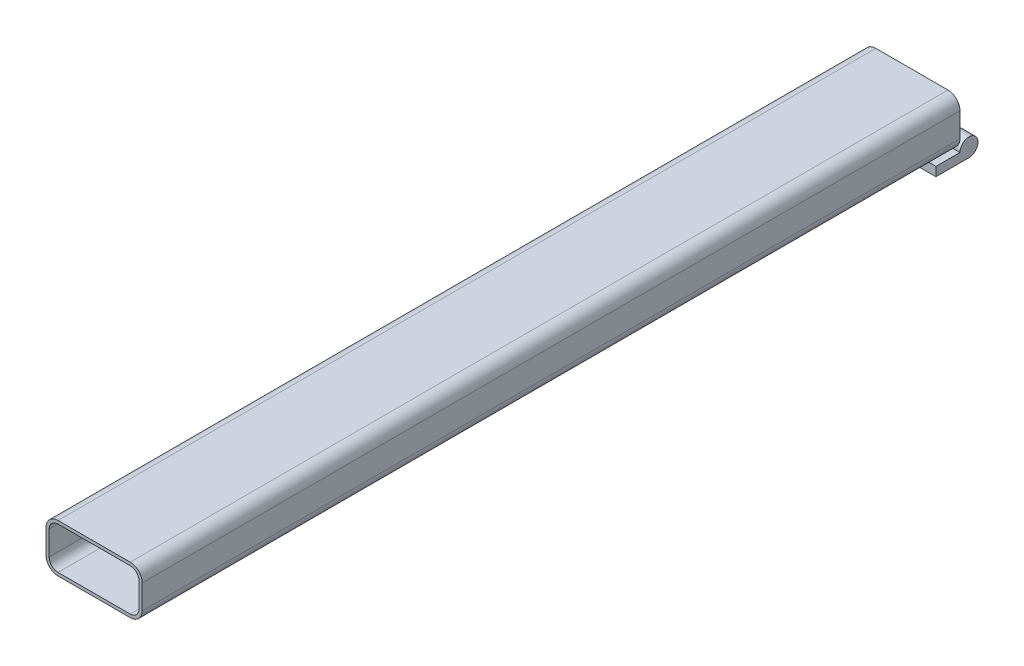
ISO-10303-21;
HEADER;
FILE_DESCRIPTION(('STEP AP214'),'2;1');
FILE_NAME('part.step','',(''),(''),'','','');
FILE_SCHEMA(('AUTOMOTIVE_DESIGN { 1 0 10303 214 1 1 1 1 }'));
ENDSEC;
DATA;
#1=APPLICATION_CONTEXT('core data for automotive mechanical design processes');
#2=APPLICATION_PROTOCOL_DEFINITION('international standard','automotive_design',2000,#1);
#3=PRODUCT_CONTEXT('',#1,'mechanical');
#4=PRODUCT('Part','Part','',(#3));
#5=PRODUCT_RELATED_PRODUCT_CATEGORY('part','',(#4));
#6=PRODUCT_DEFINITION_FORMATION('','',#4);
#7=PRODUCT_DEFINITION_CONTEXT('part definition',#1,'design');
#8=PRODUCT_DEFINITION('design','',#6,#7);
#9=PRODUCT_DEFINITION_SHAPE('','',#8);
#10=(LENGTH_UNIT() NAMED_UNIT(*) SI_UNIT(.MILLI.,.METRE.));
#11=(NAMED_UNIT(*) PLANE_ANGLE_UNIT() SI_UNIT($,.RADIAN.));
#12=(NAMED_UNIT(*) SI_UNIT($,.STERADIAN.) SOLID_ANGLE_UNIT());
#13=UNCERTAINTY_MEASURE_WITH_UNIT(LENGTH_MEASURE(1.E-05),#10,'distance_accuracy_value','');
#14=(GEOMETRIC_REPRESENTATION_CONTEXT(3) GLOBAL_UNCERTAINTY_ASSIGNED_CONTEXT((#13)) GLOBAL_UNIT_ASSIGNED_CONTEXT((#10,
#11,#12)) REPRESENTATION_CONTEXT('',''));
#15=CARTESIAN_POINT('',(0.,0.,0.));
#16=DIRECTION('',(0.,0.,1.));
#17=DIRECTION('',(1.,0.,0.));
#18=AXIS2_PLACEMENT_3D('',#15,#16,#17);
#19=CARTESIAN_POINT('',(-25.4,-12.7,-220.6625));
#20=DIRECTION('',(1.,0.,0.));
#21=DIRECTION('',(0.,0.,-1.));
#22=AXIS2_PLACEMENT_3D('',#19,#20,#21);
#23=CYLINDRICAL_SURFACE('',#22,4.7625);
#24=CARTESIAN_POINT('',(-9.525,-12.7,-220.6625));
#25=DIRECTION('',(-1.,0.,0.));
#26=DIRECTION('',(0.,0.,1.));
#27=AXIS2_PLACEMENT_3D('',#24,#25,#26);
#28=CIRCLE('',#27,4.7625);
#29=CARTESIAN_POINT('',(-9.52499999999999,-17.4625000000001,-220.6625));
#30=VERTEX_POINT('',#29);
#31=CARTESIAN_POINT('',(-9.525,-12.7,-215.9));
#32=VERTEX_POINT('',#31);
#33=EDGE_CURVE('E221',#30,#32,#28,.F.);
#34=ORIENTED_EDGE('',*,*,#33,.F.);
#35=DIRECTION('',(1.,0.,0.));
#36=VECTOR('',#35,1.);
#37=CARTESIAN_POINT('',(-25.4,-17.4625,-220.6625));
#38=LINE('',#37,#36);
#39=CARTESIAN_POINT('',(-25.4,-17.4625,-220.6625));
#40=VERTEX_POINT('',#39);
#41=EDGE_CURVE('E253',#40,#30,#38,.T.);
#42=ORIENTED_EDGE('',*,*,#41,.F.);
#43=CARTESIAN_POINT('',(-25.4,-12.7,-220.6625));
#44=DIRECTION('',(1.,0.,0.));
#45=DIRECTION('',(0.,0.,-1.));
#46=AXIS2_PLACEMENT_3D('',#43,#44,#45);
#47=CIRCLE('',#46,4.7625);
#48=CARTESIAN_POINT('',(-25.4,-12.7,-215.9));
#49=VERTEX_POINT('',#48);
#50=EDGE_CURVE('E234',#40,#49,#47,.T.);
#51=ORIENTED_EDGE('',*,*,#50,.T.);
#52=DIRECTION('',(1.,0.,0.));
#53=VECTOR('',#52,1.);
#54=CARTESIAN_POINT('',(-25.4,-12.7,-215.9));
#55=LINE('',#54,#53);
#56=CARTESIAN_POINT('',(-19.05,-12.7,-215.9));
#57=VERTEX_POINT('',#56);
#58=EDGE_CURVE('E248',#49,#57,#55,.T.);
#59=ORIENTED_EDGE('',*,*,#58,.T.);
#60=DIRECTION('',(1.,0.,0.));
#61=VECTOR('',#60,1.);
#62=CARTESIAN_POINT('',(-19.05,-12.7,-215.9));
#63=LINE('',#62,#61);
#64=EDGE_CURVE('E341',#57,#32,#63,.T.);
#65=ORIENTED_EDGE('',*,*,#64,.T.);
#66=EDGE_LOOP('',(#34,#42,#51,#59,#65));
#67=FACE_BOUND('',#66,.T.);
#68=ADVANCED_FACE('F35',(#67),#23,.T.);
#69=CARTESIAN_POINT('',(-19.05,-6.35,215.9));
#70=DIRECTION('',(0.,0.,-1.));
#71=DIRECTION('',(-1.,0.,0.));
#72=AXIS2_PLACEMENT_3D('',#69,#70,#71);
#73=PLANE('',#72);
#74=CARTESIAN_POINT('',(-19.05,-6.35,215.9));
#75=DIRECTION('',(0.,0.,1.));
#76=DIRECTION('',(-1.,0.,0.));
#77=AXIS2_PLACEMENT_3D('',#74,#75,#76);
#78=CIRCLE('',#77,6.35);
#79=CARTESIAN_POINT('',(-25.4,-6.35,215.9));
#80=VERTEX_POINT('',#79);
#81=CARTESIAN_POINT('',(-19.05,-12.7,215.9));
#82=VERTEX_POINT('',#81);
#83=EDGE_CURVE('E320',#80,#82,#78,.T.);
#84=ORIENTED_EDGE('',*,*,#83,.T.);
#85=DIRECTION('',(1.,0.,0.));
#86=VECTOR('',#85,1.);
#87=CARTESIAN_POINT('',(-19.05,-12.7,215.9));
#88=LINE('',#87,#86);
#89=CARTESIAN_POINT('',(19.05,-12.7,215.9));
#90=VERTEX_POINT('',#89);
#91=EDGE_CURVE('E323',#82,#90,#88,.T.);
#92=ORIENTED_EDGE('',*,*,#91,.T.);
#93=CARTESIAN_POINT('',(19.05,-6.35,215.9));
#94=DIRECTION('',(0.,0.,1.));
#95=DIRECTION('',(1.,0.,0.));
#96=AXIS2_PLACEMENT_3D('',#93,#94,#95);
#97=CIRCLE('',#96,6.35);
#98=CARTESIAN_POINT('',(25.4,-6.35,215.9));
#99=VERTEX_POINT('',#98);
#100=EDGE_CURVE('E326',#90,#99,#97,.T.);
#101=ORIENTED_EDGE('',*,*,#100,.T.);
#102=DIRECTION('',(0.,1.,0.));
#103=VECTOR('',#102,1.);
#104=CARTESIAN_POINT('',(25.4,-6.35,215.9));
#105=LINE('',#104,#103);
#106=CARTESIAN_POINT('',(25.4,6.35,215.9));
#107=VERTEX_POINT('',#106);
#108=EDGE_CURVE('E328',#99,#107,#105,.T.);
#109=ORIENTED_EDGE('',*,*,#108,.T.);
#110=CARTESIAN_POINT('',(19.05,6.35,215.9));
#111=DIRECTION('',(0.,0.,1.));
#112=DIRECTION('',(-1.,0.,0.));
#113=AXIS2_PLACEMENT_3D('',#110,#111,#112);
#114=CIRCLE('',#113,6.35);
#115=CARTESIAN_POINT('',(19.05,12.7,215.9));
#116=VERTEX_POINT('',#115);
#117=EDGE_CURVE('E330',#107,#116,#114,.T.);
#118=ORIENTED_EDGE('',*,*,#117,.T.);
#119=DIRECTION('',(-1.,0.,0.));
#120=VECTOR('',#119,1.);
#121=CARTESIAN_POINT('',(-19.05,12.7,215.9));
#122=LINE('',#121,#120);
#123=CARTESIAN_POINT('',(-19.05,12.7,215.9));
#124=VERTEX_POINT('',#123);
#125=EDGE_CURVE('E332',#116,#124,#122,.T.);
#126=ORIENTED_EDGE('',*,*,#125,.T.);
#127=CARTESIAN_POINT('',(-19.05,6.35,215.9));
#128=DIRECTION('',(0.,0.,1.));
#129=DIRECTION('',(-1.,0.,0.));
#130=AXIS2_PLACEMENT_3D('',#127,#128,#129);
#131=CIRCLE('',#130,6.35);
#132=CARTESIAN_POINT('',(-25.4,6.35,215.9));
#133=VERTEX_POINT('',#132);
#134=EDGE_CURVE('E334',#124,#133,#131,.T.);
#135=ORIENTED_EDGE('',*,*,#134,.T.);
#136=DIRECTION('',(0.,-1.,0.));
#137=VECTOR('',#136,1.);
#138=CARTESIAN_POINT('',(-25.4,-6.35,215.9));
#139=LINE('',#138,#137);
#140=EDGE_CURVE('E336',#133,#80,#139,.T.);
#141=ORIENTED_EDGE('',*,*,#140,.T.);
#142=EDGE_LOOP('',(#84,#92,#101,#109,#118,#126,#135,#141));
#143=FACE_BOUND('',#142,.T.);
#144=CARTESIAN_POINT('',(-19.05,6.35,215.9));
#145=DIRECTION('',(0.,0.,1.));
#146=DIRECTION('',(-1.,0.,0.));
#147=AXIS2_PLACEMENT_3D('',#144,#145,#146);
#148=CIRCLE('',#147,4.699);
#149=CARTESIAN_POINT('',(-19.05,11.049,215.9));
#150=VERTEX_POINT('',#149);
#151=CARTESIAN_POINT('',(-23.749,6.35,215.9));
#152=VERTEX_POINT('',#151);
#153=EDGE_CURVE('E264',#150,#152,#148,.T.);
#154=ORIENTED_EDGE('',*,*,#153,.F.);
#155=DIRECTION('',(-1.,0.,0.));
#156=VECTOR('',#155,1.);
#157=CARTESIAN_POINT('',(-19.05,11.049,215.9));
#158=LINE('',#157,#156);
#159=CARTESIAN_POINT('',(19.05,11.049,215.9));
#160=VERTEX_POINT('',#159);
#161=EDGE_CURVE('E279',#160,#150,#158,.T.);
#162=ORIENTED_EDGE('',*,*,#161,.F.);
#163=CARTESIAN_POINT('',(19.05,6.35,215.9));
#164=DIRECTION('',(0.,0.,1.));
#165=DIRECTION('',(-1.,0.,0.));
#166=AXIS2_PLACEMENT_3D('',#163,#164,#165);
#167=CIRCLE('',#166,4.699);
#168=CARTESIAN_POINT('',(23.749,6.35,215.9));
#169=VERTEX_POINT('',#168);
#170=EDGE_CURVE('E277',#169,#160,#167,.T.);
#171=ORIENTED_EDGE('',*,*,#170,.F.);
#172=DIRECTION('',(0.,1.,0.));
#173=VECTOR('',#172,1.);
#174=CARTESIAN_POINT('',(23.749,-6.35,215.9));
#175=LINE('',#174,#173);
#176=CARTESIAN_POINT('',(23.749,-6.35,215.9));
#177=VERTEX_POINT('',#176);
#178=EDGE_CURVE('E275',#177,#169,#175,.T.);
#179=ORIENTED_EDGE('',*,*,#178,.F.);
#180=CARTESIAN_POINT('',(19.05,-6.35,215.9));
#181=DIRECTION('',(0.,0.,1.));
#182=DIRECTION('',(1.,0.,0.));
#183=AXIS2_PLACEMENT_3D('',#180,#181,#182);
#184=CIRCLE('',#183,4.699);
#185=CARTESIAN_POINT('',(19.05,-11.049,215.9));
#186=VERTEX_POINT('',#185);
#187=EDGE_CURVE('E273',#186,#177,#184,.T.);
#188=ORIENTED_EDGE('',*,*,#187,.F.);
#189=DIRECTION('',(1.,0.,0.));
#190=VECTOR('',#189,1.);
#191=CARTESIAN_POINT('',(-19.05,-11.049,215.9));
#192=LINE('',#191,#190);
#193=CARTESIAN_POINT('',(-19.05,-11.049,215.9));
#194=VERTEX_POINT('',#193);
#195=EDGE_CURVE('E271',#194,#186,#192,.T.);
#196=ORIENTED_EDGE('',*,*,#195,.F.);
#197=CARTESIAN_POINT('',(-19.05,-6.35,215.9));
#198=DIRECTION('',(0.,0.,1.));
#199=DIRECTION('',(-1.,0.,0.));
#200=AXIS2_PLACEMENT_3D('',#197,#198,#199);
#201=CIRCLE('',#200,4.699);
#202=CARTESIAN_POINT('',(-23.749,-6.35,215.9));
#203=VERTEX_POINT('',#202);
#204=EDGE_CURVE('E269',#203,#194,#201,.T.);
#205=ORIENTED_EDGE('',*,*,#204,.F.);
#206=DIRECTION('',(0.,-1.,0.));
#207=VECTOR('',#206,1.);
#208=CARTESIAN_POINT('',(-23.749,-6.35,215.9));
#209=LINE('',#208,#207);
#210=EDGE_CURVE('E266',#152,#203,#209,.T.);
#211=ORIENTED_EDGE('',*,*,#210,.F.);
#212=EDGE_LOOP('',(#154,#162,#171,#179,#188,#196,#205,#211));
#213=FACE_BOUND('',#212,.T.);
#214=ADVANCED_FACE('F432',(#143,#213),#73,.F.);
#215=CARTESIAN_POINT('',(-19.05,-6.35,-215.9));
#216=DIRECTION('',(0.,0.,-1.));
#217=DIRECTION('',(-1.,0.,0.));
#218=AXIS2_PLACEMENT_3D('',#215,#216,#217);
#219=PLANE('',#218);
#220=DIRECTION('',(1.,0.,0.));
#221=VECTOR('',#220,1.);
#222=CARTESIAN_POINT('',(-19.05,-11.049,-215.9));
#223=LINE('',#222,#221);
#224=CARTESIAN_POINT('',(-19.05,-11.049,-215.9));
#225=VERTEX_POINT('',#224);
#226=CARTESIAN_POINT('',(19.05,-11.049,-215.9));
#227=VERTEX_POINT('',#226);
#228=EDGE_CURVE('E290',#225,#227,#223,.T.);
#229=ORIENTED_EDGE('',*,*,#228,.T.);
#230=CARTESIAN_POINT('',(19.05,-6.35,-215.9));
#231=DIRECTION('',(0.,0.,1.));
#232=DIRECTION('',(1.,0.,0.));
#233=AXIS2_PLACEMENT_3D('',#230,#231,#232);
#234=CIRCLE('',#233,4.699);
#235=CARTESIAN_POINT('',(23.749,-6.35,-215.9));
#236=VERTEX_POINT('',#235);
#237=EDGE_CURVE('E292',#227,#236,#234,.T.);
#238=ORIENTED_EDGE('',*,*,#237,.T.);
#239=DIRECTION('',(0.,1.,0.));
#240=VECTOR('',#239,1.);
#241=CARTESIAN_POINT('',(23.749,-6.35,-215.9));
#242=LINE('',#241,#240);
#243=CARTESIAN_POINT('',(23.749,6.35,-215.9));
#244=VERTEX_POINT('',#243);
#245=EDGE_CURVE('E295',#236,#244,#242,.T.);
#246=ORIENTED_EDGE('',*,*,#245,.T.);
#247=CARTESIAN_POINT('',(19.05,6.35,-215.9));
#248=DIRECTION('',(0.,0.,1.));
#249=DIRECTION('',(-1.,0.,0.));
#250=AXIS2_PLACEMENT_3D('',#247,#248,#249);
#251=CIRCLE('',#250,4.699);
#252=CARTESIAN_POINT('',(19.05,11.049,-215.9));
#253=VERTEX_POINT('',#252);
#254=EDGE_CURVE('E298',#244,#253,#251,.T.);
#255=ORIENTED_EDGE('',*,*,#254,.T.);
#256=DIRECTION('',(-1.,0.,0.));
#257=VECTOR('',#256,1.);
#258=CARTESIAN_POINT('',(-19.05,11.049,-215.9));
#259=LINE('',#258,#257);
#260=CARTESIAN_POINT('',(-19.05,11.049,-215.9));
#261=VERTEX_POINT('',#260);
#262=EDGE_CURVE('E267',#253,#261,#259,.T.);
#263=ORIENTED_EDGE('',*,*,#262,.T.);
#264=CARTESIAN_POINT('',(-19.05,6.35,-215.9));
#265=DIRECTION('',(0.,0.,1.));
#266=DIRECTION('',(-1.,0.,0.));
#267=AXIS2_PLACEMENT_3D('',#264,#265,#266);
#268=CIRCLE('',#267,4.699);
#269=CARTESIAN_POINT('',(-23.749,6.35,-215.9));
#270=VERTEX_POINT('',#269);
#271=EDGE_CURVE('E263',#261,#270,#268,.T.);
#272=ORIENTED_EDGE('',*,*,#271,.T.);
#273=DIRECTION('',(0.,-1.,0.));
#274=VECTOR('',#273,1.);
#275=CARTESIAN_POINT('',(-23.749,-6.35,-215.9));
#276=LINE('',#275,#274);
#277=CARTESIAN_POINT('',(-23.749,-6.35,-215.9));
#278=VERTEX_POINT('',#277);
#279=EDGE_CURVE('E284',#270,#278,#276,.T.);
#280=ORIENTED_EDGE('',*,*,#279,.T.);
#281=CARTESIAN_POINT('',(-19.05,-6.35,-215.9));
#282=DIRECTION('',(0.,0.,1.));
#283=DIRECTION('',(-1.,0.,0.));
#284=AXIS2_PLACEMENT_3D('',#281,#282,#283);
#285=CIRCLE('',#284,4.699);
#286=EDGE_CURVE('E287',#278,#225,#285,.T.);
#287=ORIENTED_EDGE('',*,*,#286,.T.);
#288=EDGE_LOOP('',(#229,#238,#246,#255,#263,#272,#280,#287));
#289=FACE_BOUND('',#288,.T.);
#290=DIRECTION('',(0.,-1.,0.));
#291=VECTOR('',#290,1.);
#292=CARTESIAN_POINT('',(-9.525,12.7,-215.9));
#293=LINE('',#292,#291);
#294=CARTESIAN_POINT('',(-9.525,-17.4625000000001,-215.9));
#295=VERTEX_POINT('',#294);
#296=EDGE_CURVE('E206',#32,#295,#293,.T.);
#297=ORIENTED_EDGE('',*,*,#296,.F.);
#298=ORIENTED_EDGE('',*,*,#64,.F.);
#299=CARTESIAN_POINT('',(-19.05,-6.35,-215.9));
#300=DIRECTION('',(0.,0.,1.));
#301=DIRECTION('',(-1.,0.,0.));
#302=AXIS2_PLACEMENT_3D('',#299,#300,#301);
#303=CIRCLE('',#302,6.35);
#304=CARTESIAN_POINT('',(-25.4,-6.35,-215.9));
#305=VERTEX_POINT('',#304);
#306=EDGE_CURVE('E319',#305,#57,#303,.T.);
#307=ORIENTED_EDGE('',*,*,#306,.F.);
#308=DIRECTION('',(0.,-1.,0.));
#309=VECTOR('',#308,1.);
#310=CARTESIAN_POINT('',(-25.4,-6.35,-215.9));
#311=LINE('',#310,#309);
#312=CARTESIAN_POINT('',(-25.4,6.35,-215.9));
#313=VERTEX_POINT('',#312);
#314=EDGE_CURVE('E324',#313,#305,#311,.T.);
#315=ORIENTED_EDGE('',*,*,#314,.F.);
#316=CARTESIAN_POINT('',(-19.05,6.35,-215.9));
#317=DIRECTION('',(0.,0.,1.));
#318=DIRECTION('',(-1.,0.,0.));
#319=AXIS2_PLACEMENT_3D('',#316,#317,#318);
#320=CIRCLE('',#319,6.35);
#321=CARTESIAN_POINT('',(-19.05,12.7,-215.9));
#322=VERTEX_POINT('',#321);
#323=EDGE_CURVE('E352',#322,#313,#320,.T.);
#324=ORIENTED_EDGE('',*,*,#323,.F.);
#325=DIRECTION('',(-1.,0.,0.));
#326=VECTOR('',#325,1.);
#327=CARTESIAN_POINT('',(-19.05,12.7,-215.9));
#328=LINE('',#327,#326);
#329=CARTESIAN_POINT('',(19.05,12.7,-215.9));
#330=VERTEX_POINT('',#329);
#331=EDGE_CURVE('E350',#330,#322,#328,.T.);
#332=ORIENTED_EDGE('',*,*,#331,.F.);
#333=CARTESIAN_POINT('',(19.05,6.35,-215.9));
#334=DIRECTION('',(0.,0.,1.));
#335=DIRECTION('',(-1.,0.,0.));
#336=AXIS2_PLACEMENT_3D('',#333,#334,#335);
#337=CIRCLE('',#336,6.35);
#338=CARTESIAN_POINT('',(25.4,6.35,-215.9));
#339=VERTEX_POINT('',#338);
#340=EDGE_CURVE('E348',#339,#330,#337,.T.);
#341=ORIENTED_EDGE('',*,*,#340,.F.);
#342=DIRECTION('',(0.,1.,0.));
#343=VECTOR('',#342,1.);
#344=CARTESIAN_POINT('',(25.4,-6.35,-215.9));
#345=LINE('',#344,#343);
#346=CARTESIAN_POINT('',(25.4,-6.35,-215.9));
#347=VERTEX_POINT('',#346);
#348=EDGE_CURVE('E346',#347,#339,#345,.T.);
#349=ORIENTED_EDGE('',*,*,#348,.F.);
#350=CARTESIAN_POINT('',(19.05,-6.35,-215.9));
#351=DIRECTION('',(0.,0.,1.));
#352=DIRECTION('',(1.,0.,0.));
#353=AXIS2_PLACEMENT_3D('',#350,#351,#352);
#354=CIRCLE('',#353,6.35);
#355=CARTESIAN_POINT('',(19.05,-12.7,-215.9));
#356=VERTEX_POINT('',#355);
#357=EDGE_CURVE('E344',#356,#347,#354,.T.);
#358=ORIENTED_EDGE('',*,*,#357,.F.);
#359=CARTESIAN_POINT('',(9.525,-12.7,-215.9));
#360=VERTEX_POINT('',#359);
#361=EDGE_CURVE('E205',#360,#356,#63,.T.);
#362=ORIENTED_EDGE('',*,*,#361,.F.);
#363=DIRECTION('',(0.,-1.,0.));
#364=VECTOR('',#363,1.);
#365=CARTESIAN_POINT('',(9.52500000000001,12.7,-215.9));
#366=LINE('',#365,#364);
#367=CARTESIAN_POINT('',(9.52500000000001,-17.4625000000001,-215.9));
#368=VERTEX_POINT('',#367);
#369=EDGE_CURVE('E198',#360,#368,#366,.T.);
#370=ORIENTED_EDGE('',*,*,#369,.T.);
#371=DIRECTION('',(-1.,0.,0.));
#372=VECTOR('',#371,1.);
#373=CARTESIAN_POINT('',(-9.525,-17.4625000000001,-215.9));
#374=LINE('',#373,#372);
#375=EDGE_CURVE('E202',#368,#295,#374,.T.);
#376=ORIENTED_EDGE('',*,*,#375,.T.);
#377=EDGE_LOOP('',(#297,#298,#307,#315,#324,#332,#341,#349,#358,#362,#370,#376));
#378=FACE_BOUND('',#377,.T.);
#379=ADVANCED_FACE('F200',(#289,#378),#219,.T.);
#380=CARTESIAN_POINT('',(-19.05,-6.35,215.9));
#381=DIRECTION('',(0.,0.,-1.));
#382=DIRECTION('',(-1.,0.,0.));
#383=AXIS2_PLACEMENT_3D('',#380,#381,#382);
#384=CYLINDRICAL_SURFACE('',#383,6.35);
#385=ORIENTED_EDGE('',*,*,#306,.T.);
#386=DIRECTION('',(0.,0.,-1.));
#387=VECTOR('',#386,1.);
#388=CARTESIAN_POINT('',(-19.05,-12.7,215.9));
#389=LINE('',#388,#387);
#390=CARTESIAN_POINT('',(-19.05,-12.7,-203.2));
#391=VERTEX_POINT('',#390);
#392=EDGE_CURVE('E251',#391,#57,#389,.T.);
#393=ORIENTED_EDGE('',*,*,#392,.F.);
#394=DIRECTION('',(0.,0.,-1.));
#395=VECTOR('',#394,1.);
#396=CARTESIAN_POINT('',(-19.05,-12.7,215.9));
#397=LINE('',#396,#395);
#398=EDGE_CURVE('E213',#82,#391,#397,.T.);
#399=ORIENTED_EDGE('',*,*,#398,.F.);
#400=ORIENTED_EDGE('',*,*,#83,.F.);
#401=DIRECTION('',(0.,0.,-1.));
#402=VECTOR('',#401,1.);
#403=CARTESIAN_POINT('',(-25.4,-6.35,215.9));
#404=LINE('',#403,#402);
#405=EDGE_CURVE('E338',#80,#305,#404,.T.);
#406=ORIENTED_EDGE('',*,*,#405,.T.);
#407=EDGE_LOOP('',(#385,#393,#399,#400,#406));
#408=FACE_BOUND('',#407,.T.);
#409=ADVANCED_FACE('F37',(#408),#384,.T.);
#410=CARTESIAN_POINT('',(-19.05,-12.7,215.9));
#411=DIRECTION('',(0.,1.,0.));
#412=DIRECTION('',(0.,0.,1.));
#413=AXIS2_PLACEMENT_3D('',#410,#411,#412);
#414=PLANE('',#413);
#415=ORIENTED_EDGE('',*,*,#398,.T.);
#416=DIRECTION('',(1.,0.,0.));
#417=VECTOR('',#416,1.);
#418=CARTESIAN_POINT('',(-25.4,-12.7,-203.2));
#419=LINE('',#418,#417);
#420=CARTESIAN_POINT('',(19.05,-12.7,-203.2));
#421=VERTEX_POINT('',#420);
#422=EDGE_CURVE('E261',#391,#421,#419,.T.);
#423=ORIENTED_EDGE('',*,*,#422,.T.);
#424=DIRECTION('',(0.,0.,-1.));
#425=VECTOR('',#424,1.);
#426=CARTESIAN_POINT('',(19.05,-12.7,215.9));
#427=LINE('',#426,#425);
#428=EDGE_CURVE('E373',#90,#421,#427,.T.);
#429=ORIENTED_EDGE('',*,*,#428,.F.);
#430=ORIENTED_EDGE('',*,*,#91,.F.);
#431=EDGE_LOOP('',(#415,#423,#429,#430));
#432=FACE_BOUND('',#431,.T.);
#433=ADVANCED_FACE('F380',(#432),#414,.F.);
#434=CARTESIAN_POINT('',(19.05,-6.35,215.9));
#435=DIRECTION('',(0.,0.,-1.));
#436=DIRECTION('',(-1.,0.,0.));
#437=AXIS2_PLACEMENT_3D('',#434,#435,#436);
#438=CYLINDRICAL_SURFACE('',#437,6.35);
#439=ORIENTED_EDGE('',*,*,#357,.T.);
#440=DIRECTION('',(0.,0.,-1.));
#441=VECTOR('',#440,1.);
#442=CARTESIAN_POINT('',(25.4,-6.35,215.9));
#443=LINE('',#442,#441);
#444=EDGE_CURVE('E369',#99,#347,#443,.T.);
#445=ORIENTED_EDGE('',*,*,#444,.F.);
#446=ORIENTED_EDGE('',*,*,#100,.F.);
#447=ORIENTED_EDGE('',*,*,#428,.T.);
#448=EDGE_CURVE('E372',#421,#356,#427,.T.);
#449=ORIENTED_EDGE('',*,*,#448,.T.);
#450=EDGE_LOOP('',(#439,#445,#446,#447,#449));
#451=FACE_BOUND('',#450,.T.);
#452=ADVANCED_FACE('F416',(#451),#438,.T.);
#453=CARTESIAN_POINT('',(25.4,-6.35,215.9));
#454=DIRECTION('',(-1.,0.,0.));
#455=DIRECTION('',(0.,0.,1.));
#456=AXIS2_PLACEMENT_3D('',#453,#454,#455);
#457=PLANE('',#456);
#458=ORIENTED_EDGE('',*,*,#348,.T.);
#459=DIRECTION('',(0.,0.,-1.));
#460=VECTOR('',#459,1.);
#461=CARTESIAN_POINT('',(25.4,6.35,215.9));
#462=LINE('',#461,#460);
#463=EDGE_CURVE('E366',#107,#339,#462,.T.);
#464=ORIENTED_EDGE('',*,*,#463,.F.);
#465=ORIENTED_EDGE('',*,*,#108,.F.);
#466=ORIENTED_EDGE('',*,*,#444,.T.);
#467=EDGE_LOOP('',(#458,#464,#465,#466));
#468=FACE_BOUND('',#467,.T.);
#469=ADVANCED_FACE('F424',(#468),#457,.F.);
#470=CARTESIAN_POINT('',(19.05,6.35,215.9));
#471=DIRECTION('',(0.,0.,-1.));
#472=DIRECTION('',(-1.,0.,0.));
#473=AXIS2_PLACEMENT_3D('',#470,#471,#472);
#474=CYLINDRICAL_SURFACE('',#473,6.35);
#475=ORIENTED_EDGE('',*,*,#340,.T.);
#476=DIRECTION('',(0.,0.,-1.));
#477=VECTOR('',#476,1.);
#478=CARTESIAN_POINT('',(19.05,12.7,215.9));
#479=LINE('',#478,#477);
#480=EDGE_CURVE('E363',#116,#330,#479,.T.);
#481=ORIENTED_EDGE('',*,*,#480,.F.);
#482=ORIENTED_EDGE('',*,*,#117,.F.);
#483=ORIENTED_EDGE('',*,*,#463,.T.);
#484=EDGE_LOOP('',(#475,#481,#482,#483));
#485=FACE_BOUND('',#484,.T.);
#486=ADVANCED_FACE('F428',(#485),#474,.T.);
#487=CARTESIAN_POINT('',(-19.05,12.7,215.9));
#488=DIRECTION('',(0.,-1.,0.));
#489=DIRECTION('',(0.,0.,-1.));
#490=AXIS2_PLACEMENT_3D('',#487,#488,#489);
#491=PLANE('',#490);
#492=ORIENTED_EDGE('',*,*,#331,.T.);
#493=DIRECTION('',(0.,0.,-1.));
#494=VECTOR('',#493,1.);
#495=CARTESIAN_POINT('',(-19.05,12.7,215.9));
#496=LINE('',#495,#494);
#497=EDGE_CURVE('E360',#124,#322,#496,.T.);
#498=ORIENTED_EDGE('',*,*,#497,.F.);
#499=ORIENTED_EDGE('',*,*,#125,.F.);
#500=ORIENTED_EDGE('',*,*,#480,.T.);
#501=EDGE_LOOP('',(#492,#498,#499,#500));
#502=FACE_BOUND('',#501,.T.);
#503=ADVANCED_FACE('F445',(#502),#491,.F.);
#504=CARTESIAN_POINT('',(-19.05,6.35,215.9));
#505=DIRECTION('',(0.,0.,-1.));
#506=DIRECTION('',(-1.,0.,0.));
#507=AXIS2_PLACEMENT_3D('',#504,#505,#506);
#508=CYLINDRICAL_SURFACE('',#507,6.35);
#509=ORIENTED_EDGE('',*,*,#323,.T.);
#510=DIRECTION('',(0.,0.,-1.));
#511=VECTOR('',#510,1.);
#512=CARTESIAN_POINT('',(-25.4,6.35,215.9));
#513=LINE('',#512,#511);
#514=EDGE_CURVE('E357',#133,#313,#513,.T.);
#515=ORIENTED_EDGE('',*,*,#514,.F.);
#516=ORIENTED_EDGE('',*,*,#134,.F.);
#517=ORIENTED_EDGE('',*,*,#497,.T.);
#518=EDGE_LOOP('',(#509,#515,#516,#517));
#519=FACE_BOUND('',#518,.T.);
#520=ADVANCED_FACE('F443',(#519),#508,.T.);
#521=CARTESIAN_POINT('',(-25.4,-6.35,215.9));
#522=DIRECTION('',(1.,0.,0.));
#523=DIRECTION('',(0.,0.,-1.));
#524=AXIS2_PLACEMENT_3D('',#521,#522,#523);
#525=PLANE('',#524);
#526=ORIENTED_EDGE('',*,*,#314,.T.);
#527=ORIENTED_EDGE('',*,*,#405,.F.);
#528=ORIENTED_EDGE('',*,*,#140,.F.);
#529=ORIENTED_EDGE('',*,*,#514,.T.);
#530=EDGE_LOOP('',(#526,#527,#528,#529));
#531=FACE_BOUND('',#530,.T.);
#532=ADVANCED_FACE('F440',(#531),#525,.F.);
#533=CARTESIAN_POINT('',(-19.05,6.35,215.9));
#534=DIRECTION('',(0.,0.,-1.));
#535=DIRECTION('',(-1.,0.,0.));
#536=AXIS2_PLACEMENT_3D('',#533,#534,#535);
#537=CYLINDRICAL_SURFACE('',#536,4.699);
#538=ORIENTED_EDGE('',*,*,#271,.F.);
#539=DIRECTION('',(0.,0.,-1.));
#540=VECTOR('',#539,1.);
#541=CARTESIAN_POINT('',(-19.05,11.049,215.9));
#542=LINE('',#541,#540);
#543=EDGE_CURVE('E281',#150,#261,#542,.T.);
#544=ORIENTED_EDGE('',*,*,#543,.F.);
#545=ORIENTED_EDGE('',*,*,#153,.T.);
#546=DIRECTION('',(0.,0.,-1.));
#547=VECTOR('',#546,1.);
#548=CARTESIAN_POINT('',(-23.749,6.35,215.9));
#549=LINE('',#548,#547);
#550=EDGE_CURVE('E316',#152,#270,#549,.T.);
#551=ORIENTED_EDGE('',*,*,#550,.T.);
#552=EDGE_LOOP('',(#538,#544,#545,#551));
#553=FACE_BOUND('',#552,.T.);
#554=ADVANCED_FACE('F499',(#553),#537,.F.);
#555=CARTESIAN_POINT('',(-23.749,-6.35,215.9));
#556=DIRECTION('',(1.,0.,0.));
#557=DIRECTION('',(0.,0.,-1.));
#558=AXIS2_PLACEMENT_3D('',#555,#556,#557);
#559=PLANE('',#558);
#560=ORIENTED_EDGE('',*,*,#279,.F.);
#561=ORIENTED_EDGE('',*,*,#550,.F.);
#562=ORIENTED_EDGE('',*,*,#210,.T.);
#563=DIRECTION('',(0.,0.,-1.));
#564=VECTOR('',#563,1.);
#565=CARTESIAN_POINT('',(-23.749,-6.35,215.9));
#566=LINE('',#565,#564);
#567=EDGE_CURVE('E314',#203,#278,#566,.T.);
#568=ORIENTED_EDGE('',*,*,#567,.T.);
#569=EDGE_LOOP('',(#560,#561,#562,#568));
#570=FACE_BOUND('',#569,.T.);
#571=ADVANCED_FACE('F495',(#570),#559,.T.);
#572=CARTESIAN_POINT('',(-19.05,-6.35,215.9));
#573=DIRECTION('',(0.,0.,-1.));
#574=DIRECTION('',(-1.,0.,0.));
#575=AXIS2_PLACEMENT_3D('',#572,#573,#574);
#576=CYLINDRICAL_SURFACE('',#575,4.699);
#577=ORIENTED_EDGE('',*,*,#286,.F.);
#578=ORIENTED_EDGE('',*,*,#567,.F.);
#579=ORIENTED_EDGE('',*,*,#204,.T.);
#580=DIRECTION('',(0.,0.,-1.));
#581=VECTOR('',#580,1.);
#582=CARTESIAN_POINT('',(-19.05,-11.049,215.9));
#583=LINE('',#582,#581);
#584=EDGE_CURVE('E312',#194,#225,#583,.T.);
#585=ORIENTED_EDGE('',*,*,#584,.T.);
#586=EDGE_LOOP('',(#577,#578,#579,#585));
#587=FACE_BOUND('',#586,.T.);
#588=ADVANCED_FACE('F491',(#587),#576,.F.);
#589=CARTESIAN_POINT('',(-19.05,-11.049,215.9));
#590=DIRECTION('',(0.,1.,0.));
#591=DIRECTION('',(0.,0.,1.));
#592=AXIS2_PLACEMENT_3D('',#589,#590,#591);
#593=PLANE('',#592);
#594=ORIENTED_EDGE('',*,*,#228,.F.);
#595=ORIENTED_EDGE('',*,*,#584,.F.);
#596=ORIENTED_EDGE('',*,*,#195,.T.);
#597=DIRECTION('',(0.,0.,-1.));
#598=VECTOR('',#597,1.);
#599=CARTESIAN_POINT('',(19.05,-11.049,215.9));
#600=LINE('',#599,#598);
#601=EDGE_CURVE('E309',#186,#227,#600,.T.);
#602=ORIENTED_EDGE('',*,*,#601,.T.);
#603=EDGE_LOOP('',(#594,#595,#596,#602));
#604=FACE_BOUND('',#603,.T.);
#605=ADVANCED_FACE('F487',(#604),#593,.T.);
#606=CARTESIAN_POINT('',(19.05,-6.35,215.9));
#607=DIRECTION('',(0.,0.,-1.));
#608=DIRECTION('',(-1.,0.,0.));
#609=AXIS2_PLACEMENT_3D('',#606,#607,#608);
#610=CYLINDRICAL_SURFACE('',#609,4.699);
#611=ORIENTED_EDGE('',*,*,#237,.F.);
#612=ORIENTED_EDGE('',*,*,#601,.F.);
#613=ORIENTED_EDGE('',*,*,#187,.T.);
#614=DIRECTION('',(0.,0.,-1.));
#615=VECTOR('',#614,1.);
#616=CARTESIAN_POINT('',(23.749,-6.35,215.9));
#617=LINE('',#616,#615);
#618=EDGE_CURVE('E307',#177,#236,#617,.T.);
#619=ORIENTED_EDGE('',*,*,#618,.T.);
#620=EDGE_LOOP('',(#611,#612,#613,#619));
#621=FACE_BOUND('',#620,.T.);
#622=ADVANCED_FACE('F483',(#621),#610,.F.);
#623=CARTESIAN_POINT('',(23.749,-6.35,215.9));
#624=DIRECTION('',(-1.,0.,0.));
#625=DIRECTION('',(0.,-1.,0.));
#626=AXIS2_PLACEMENT_3D('',#623,#624,#625);
#627=PLANE('',#626);
#628=ORIENTED_EDGE('',*,*,#245,.F.);
#629=ORIENTED_EDGE('',*,*,#618,.F.);
#630=ORIENTED_EDGE('',*,*,#178,.T.);
#631=DIRECTION('',(0.,0.,-1.));
#632=VECTOR('',#631,1.);
#633=CARTESIAN_POINT('',(23.749,6.35,215.9));
#634=LINE('',#633,#632);
#635=EDGE_CURVE('E305',#169,#244,#634,.T.);
#636=ORIENTED_EDGE('',*,*,#635,.T.);
#637=EDGE_LOOP('',(#628,#629,#630,#636));
#638=FACE_BOUND('',#637,.T.);
#639=ADVANCED_FACE('F479',(#638),#627,.T.);
#640=CARTESIAN_POINT('',(19.05,6.35,215.9));
#641=DIRECTION('',(0.,0.,-1.));
#642=DIRECTION('',(-1.,0.,0.));
#643=AXIS2_PLACEMENT_3D('',#640,#641,#642);
#644=CYLINDRICAL_SURFACE('',#643,4.699);
#645=ORIENTED_EDGE('',*,*,#254,.F.);
#646=ORIENTED_EDGE('',*,*,#635,.F.);
#647=ORIENTED_EDGE('',*,*,#170,.T.);
#648=DIRECTION('',(0.,0.,-1.));
#649=VECTOR('',#648,1.);
#650=CARTESIAN_POINT('',(19.05,11.049,215.9));
#651=LINE('',#650,#649);
#652=EDGE_CURVE('E59',#160,#253,#651,.T.);
#653=ORIENTED_EDGE('',*,*,#652,.T.);
#654=EDGE_LOOP('',(#645,#646,#647,#653));
#655=FACE_BOUND('',#654,.T.);
#656=ADVANCED_FACE('F476',(#655),#644,.F.);
#657=CARTESIAN_POINT('',(-19.05,11.049,215.9));
#658=DIRECTION('',(0.,-1.,0.));
#659=DIRECTION('',(0.,0.,-1.));
#660=AXIS2_PLACEMENT_3D('',#657,#658,#659);
#661=PLANE('',#660);
#662=ORIENTED_EDGE('',*,*,#262,.F.);
#663=ORIENTED_EDGE('',*,*,#652,.F.);
#664=ORIENTED_EDGE('',*,*,#161,.T.);
#665=ORIENTED_EDGE('',*,*,#543,.T.);
#666=EDGE_LOOP('',(#662,#663,#664,#665));
#667=FACE_BOUND('',#666,.T.);
#668=ADVANCED_FACE('F471',(#667),#661,.T.);
#669=CARTESIAN_POINT('',(-25.4,-12.7,-215.9));
#670=DIRECTION('',(0.,1.,0.));
#671=DIRECTION('',(0.,0.,1.));
#672=AXIS2_PLACEMENT_3D('',#669,#670,#671);
#673=PLANE('',#672);
#674=ORIENTED_EDGE('',*,*,#448,.F.);
#675=CARTESIAN_POINT('',(25.4,-12.7,-203.2));
#676=VERTEX_POINT('',#675);
#677=EDGE_CURVE('E237',#421,#676,#419,.T.);
#678=ORIENTED_EDGE('',*,*,#677,.T.);
#679=DIRECTION('',(0.,0.,1.));
#680=VECTOR('',#679,1.);
#681=CARTESIAN_POINT('',(25.4,-12.7,-215.9));
#682=LINE('',#681,#680);
#683=CARTESIAN_POINT('',(25.4,-12.7,-215.9));
#684=VERTEX_POINT('',#683);
#685=EDGE_CURVE('E223',#684,#676,#682,.T.);
#686=ORIENTED_EDGE('',*,*,#685,.F.);
#687=EDGE_CURVE('E252',#356,#684,#55,.T.);
#688=ORIENTED_EDGE('',*,*,#687,.F.);
#689=EDGE_LOOP('',(#674,#678,#686,#688));
#690=FACE_BOUND('',#689,.T.);
#691=ADVANCED_FACE('F407',(#690),#673,.T.);
#692=CARTESIAN_POINT('',(-25.4,-12.7,-203.2));
#693=VERTEX_POINT('',#692);
#694=EDGE_CURVE('E258',#693,#391,#419,.T.);
#695=ORIENTED_EDGE('',*,*,#694,.T.);
#696=ORIENTED_EDGE('',*,*,#392,.T.);
#697=ORIENTED_EDGE('',*,*,#58,.F.);
#698=DIRECTION('',(0.,0.,1.));
#699=VECTOR('',#698,1.);
#700=CARTESIAN_POINT('',(-25.4,-12.7,-215.9));
#701=LINE('',#700,#699);
#702=EDGE_CURVE('E224',#49,#693,#701,.T.);
#703=ORIENTED_EDGE('',*,*,#702,.T.);
#704=EDGE_LOOP('',(#695,#696,#697,#703));
#705=FACE_BOUND('',#704,.T.);
#706=ADVANCED_FACE('F387',(#705),#673,.T.);
#707=CARTESIAN_POINT('',(9.525,-12.7,-220.6625));
#708=DIRECTION('',(1.,0.,0.));
#709=DIRECTION('',(0.,0.,-1.));
#710=AXIS2_PLACEMENT_3D('',#707,#708,#709);
#711=CIRCLE('',#710,4.7625);
#712=CARTESIAN_POINT('',(9.525,-17.4625,-220.6625));
#713=VERTEX_POINT('',#712);
#714=EDGE_CURVE('E51',#360,#713,#711,.F.);
#715=ORIENTED_EDGE('',*,*,#714,.F.);
#716=ORIENTED_EDGE('',*,*,#361,.T.);
#717=ORIENTED_EDGE('',*,*,#687,.T.);
#718=CARTESIAN_POINT('',(25.4,-12.7,-220.6625));
#719=DIRECTION('',(1.,0.,0.));
#720=DIRECTION('',(0.,0.,-1.));
#721=AXIS2_PLACEMENT_3D('',#718,#719,#720);
#722=CIRCLE('',#721,4.7625);
#723=CARTESIAN_POINT('',(25.4,-17.4625,-220.6625));
#724=VERTEX_POINT('',#723);
#725=EDGE_CURVE('E228',#724,#684,#722,.T.);
#726=ORIENTED_EDGE('',*,*,#725,.F.);
#727=EDGE_CURVE('E255',#713,#724,#38,.T.);
#728=ORIENTED_EDGE('',*,*,#727,.F.);
#729=EDGE_LOOP('',(#715,#716,#717,#726,#728));
#730=FACE_BOUND('',#729,.T.);
#731=ADVANCED_FACE('F414',(#730),#23,.T.);
#732=CARTESIAN_POINT('',(-25.4,-17.4625,-203.2));
#733=DIRECTION('',(0.,-1.,0.));
#734=DIRECTION('',(0.,0.,-1.));
#735=AXIS2_PLACEMENT_3D('',#732,#733,#734);
#736=PLANE('',#735);
#737=DIRECTION('',(0.,0.,-1.));
#738=VECTOR('',#737,1.);
#739=CARTESIAN_POINT('',(-9.52499999999999,-17.4625000000001,-225.425));
#740=LINE('',#739,#738);
#741=EDGE_CURVE('E207',#295,#30,#740,.T.);
#742=ORIENTED_EDGE('',*,*,#741,.F.);
#743=ORIENTED_EDGE('',*,*,#375,.F.);
#744=DIRECTION('',(0.,0.,1.));
#745=VECTOR('',#744,1.);
#746=CARTESIAN_POINT('',(9.525,-17.4625,-203.2));
#747=LINE('',#746,#745);
#748=EDGE_CURVE('E209',#713,#368,#747,.T.);
#749=ORIENTED_EDGE('',*,*,#748,.F.);
#750=ORIENTED_EDGE('',*,*,#727,.T.);
#751=DIRECTION('',(0.,0.,-1.));
#752=VECTOR('',#751,1.);
#753=CARTESIAN_POINT('',(25.4,-17.4625,-203.2));
#754=LINE('',#753,#752);
#755=CARTESIAN_POINT('',(25.4,-17.4625,-203.2));
#756=VERTEX_POINT('',#755);
#757=EDGE_CURVE('E243',#756,#724,#754,.T.);
#758=ORIENTED_EDGE('',*,*,#757,.F.);
#759=DIRECTION('',(1.,0.,0.));
#760=VECTOR('',#759,1.);
#761=CARTESIAN_POINT('',(-25.4,-17.4625,-203.2));
#762=LINE('',#761,#760);
#763=CARTESIAN_POINT('',(-25.4,-17.4625,-203.2));
#764=VERTEX_POINT('',#763);
#765=EDGE_CURVE('E256',#764,#756,#762,.T.);
#766=ORIENTED_EDGE('',*,*,#765,.F.);
#767=DIRECTION('',(0.,0.,-1.));
#768=VECTOR('',#767,1.);
#769=CARTESIAN_POINT('',(-25.4,-17.4625,-203.2));
#770=LINE('',#769,#768);
#771=EDGE_CURVE('E231',#764,#40,#770,.T.);
#772=ORIENTED_EDGE('',*,*,#771,.T.);
#773=ORIENTED_EDGE('',*,*,#41,.T.);
#774=EDGE_LOOP('',(#742,#743,#749,#750,#758,#766,#772,#773));
#775=FACE_BOUND('',#774,.T.);
#776=ADVANCED_FACE('F214',(#775),#736,.T.);
#777=CARTESIAN_POINT('',(-25.4,-12.7,-203.2));
#778=DIRECTION('',(0.,0.,1.));
#779=DIRECTION('',(1.,0.,0.));
#780=AXIS2_PLACEMENT_3D('',#777,#778,#779);
#781=PLANE('',#780);
#782=DIRECTION('',(0.,-1.,0.));
#783=VECTOR('',#782,1.);
#784=CARTESIAN_POINT('',(25.4,-12.7,-203.2));
#785=LINE('',#784,#783);
#786=EDGE_CURVE('E240',#676,#756,#785,.T.);
#787=ORIENTED_EDGE('',*,*,#786,.F.);
#788=ORIENTED_EDGE('',*,*,#677,.F.);
#789=ORIENTED_EDGE('',*,*,#422,.F.);
#790=ORIENTED_EDGE('',*,*,#694,.F.);
#791=DIRECTION('',(0.,-1.,0.));
#792=VECTOR('',#791,1.);
#793=CARTESIAN_POINT('',(-25.4,-12.7,-203.2));
#794=LINE('',#793,#792);
#795=EDGE_CURVE('E227',#693,#764,#794,.T.);
#796=ORIENTED_EDGE('',*,*,#795,.T.);
#797=ORIENTED_EDGE('',*,*,#765,.T.);
#798=EDGE_LOOP('',(#787,#788,#789,#790,#796,#797));
#799=FACE_BOUND('',#798,.T.);
#800=ADVANCED_FACE('F403',(#799),#781,.T.);
#801=CARTESIAN_POINT('',(-25.4,-12.7,-220.6625));
#802=DIRECTION('',(1.,0.,0.));
#803=DIRECTION('',(0.,0.,-1.));
#804=AXIS2_PLACEMENT_3D('',#801,#802,#803);
#805=PLANE('',#804);
#806=ORIENTED_EDGE('',*,*,#702,.F.);
#807=ORIENTED_EDGE('',*,*,#50,.F.);
#808=ORIENTED_EDGE('',*,*,#771,.F.);
#809=ORIENTED_EDGE('',*,*,#795,.F.);
#810=EDGE_LOOP('',(#806,#807,#808,#809));
#811=FACE_BOUND('',#810,.T.);
#812=ADVANCED_FACE('F400',(#811),#805,.F.);
#813=CARTESIAN_POINT('',(25.4,-12.7,-220.6625));
#814=DIRECTION('',(1.,0.,0.));
#815=DIRECTION('',(0.,0.,-1.));
#816=AXIS2_PLACEMENT_3D('',#813,#814,#815);
#817=PLANE('',#816);
#818=ORIENTED_EDGE('',*,*,#685,.T.);
#819=ORIENTED_EDGE('',*,*,#786,.T.);
#820=ORIENTED_EDGE('',*,*,#757,.T.);
#821=ORIENTED_EDGE('',*,*,#725,.T.);
#822=EDGE_LOOP('',(#818,#819,#820,#821));
#823=FACE_BOUND('',#822,.T.);
#824=ADVANCED_FACE('F411',(#823),#817,.T.);
#825=CARTESIAN_POINT('',(-9.52499999999999,12.7,-225.425));
#826=DIRECTION('',(-1.,0.,0.));
#827=DIRECTION('',(0.,0.,1.));
#828=AXIS2_PLACEMENT_3D('',#825,#826,#827);
#829=PLANE('',#828);
#830=CARTESIAN_POINT('',(-9.525,-12.7,-220.6625));
#831=DIRECTION('',(-1.,0.,0.));
#832=DIRECTION('',(0.,0.,1.));
#833=AXIS2_PLACEMENT_3D('',#830,#831,#832);
#834=CIRCLE('',#833,3.17499999999997);
#835=CARTESIAN_POINT('',(-9.525,-12.7,-217.4875));
#836=VERTEX_POINT('',#835);
#837=EDGE_CURVE('E11',#836,#836,#834,.F.);
#838=ORIENTED_EDGE('',*,*,#837,.F.);
#839=EDGE_LOOP('',(#838));
#840=FACE_BOUND('',#839,.T.);
#841=ORIENTED_EDGE('',*,*,#33,.T.);
#842=ORIENTED_EDGE('',*,*,#296,.T.);
#843=ORIENTED_EDGE('',*,*,#741,.T.);
#844=EDGE_LOOP('',(#841,#842,#843));
#845=FACE_BOUND('',#844,.T.);
#846=ADVANCED_FACE('F395',(#840,#845),#829,.F.);
#847=CARTESIAN_POINT('',(9.52500000000001,12.7,-215.9));
#848=DIRECTION('',(1.,0.,0.));
#849=DIRECTION('',(0.,0.,-1.));
#850=AXIS2_PLACEMENT_3D('',#847,#848,#849);
#851=PLANE('',#850);
#852=CARTESIAN_POINT('',(9.52500000000001,-12.7,-220.6625));
#853=DIRECTION('',(1.,0.,0.));
#854=DIRECTION('',(0.,0.,-1.));
#855=AXIS2_PLACEMENT_3D('',#852,#853,#854);
#856=CIRCLE('',#855,3.17499999999997);
#857=CARTESIAN_POINT('',(9.52500000000001,-12.7,-223.8375));
#858=VERTEX_POINT('',#857);
#859=EDGE_CURVE('E39',#858,#858,#856,.F.);
#860=ORIENTED_EDGE('',*,*,#859,.F.);
#861=EDGE_LOOP('',(#860));
#862=FACE_BOUND('',#861,.T.);
#863=ORIENTED_EDGE('',*,*,#714,.T.);
#864=ORIENTED_EDGE('',*,*,#748,.T.);
#865=ORIENTED_EDGE('',*,*,#369,.F.);
#866=EDGE_LOOP('',(#863,#864,#865));
#867=FACE_BOUND('',#866,.T.);
#868=ADVANCED_FACE('F210',(#862,#867),#851,.F.);
#869=CARTESIAN_POINT('',(19.05,-12.7,-220.6625));
#870=DIRECTION('',(-1.,0.,0.));
#871=DIRECTION('',(0.,0.,1.));
#872=AXIS2_PLACEMENT_3D('',#869,#870,#871);
#873=CYLINDRICAL_SURFACE('',#872,3.17499999999997);
#874=ORIENTED_EDGE('',*,*,#859,.T.);
#875=EDGE_LOOP('',(#874));
#876=FACE_BOUND('',#875,.T.);
#877=ORIENTED_EDGE('',*,*,#837,.T.);
#878=EDGE_LOOP('',(#877));
#879=FACE_BOUND('',#878,.T.);
#880=ADVANCED_FACE('F676',(#876,#879),#873,.T.);
#881=CLOSED_SHELL('',(#68,#214,#379,#409,#433,#452,#469,#486,#503,#520,#532,#554,#571,#588,#605,
#622,#639,#656,#668,#691,#706,#731,#776,#800,#812,#824,#846,#868,#880));
#882=MANIFOLD_SOLID_BREP('B2',#881);
#883=ADVANCED_BREP_SHAPE_REPRESENTATION('',(#18,#882),#14);
#884=SHAPE_DEFINITION_REPRESENTATION(#9,#883);
ENDSEC;
END-ISO-10303-21;
